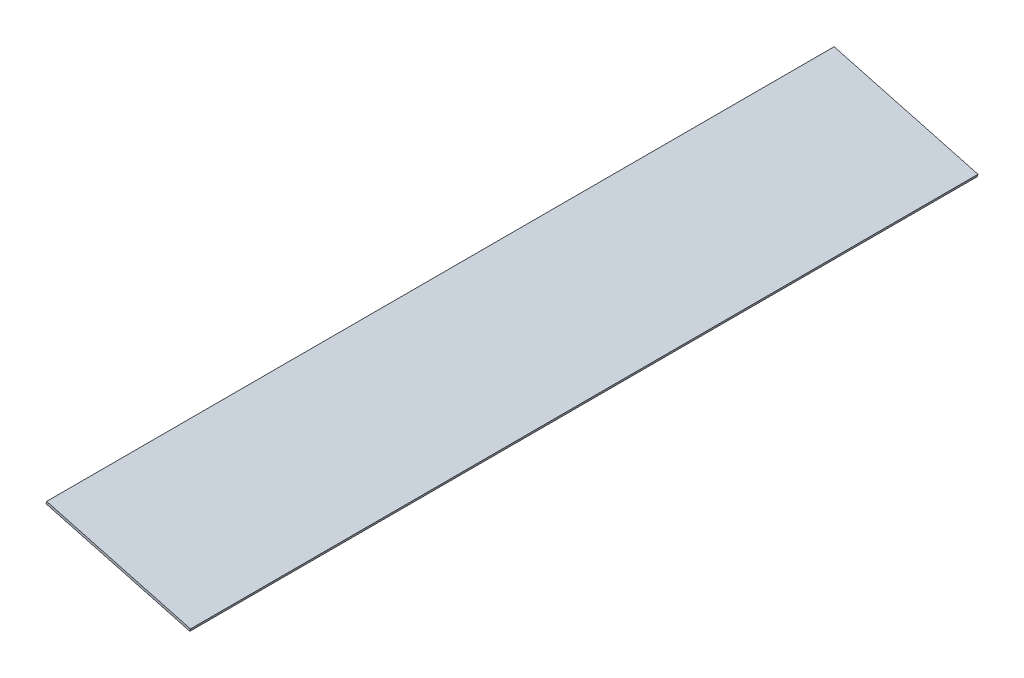
ISO-10303-21;
HEADER;
FILE_DESCRIPTION(('STEP AP214'),'2;1');
FILE_NAME('part.step','',(''),(''),'','','');
FILE_SCHEMA(('AUTOMOTIVE_DESIGN { 1 0 10303 214 1 1 1 1 }'));
ENDSEC;
DATA;
#1=APPLICATION_CONTEXT('core data for automotive mechanical design processes');
#2=APPLICATION_PROTOCOL_DEFINITION('international standard','automotive_design',2000,#1);
#3=PRODUCT_CONTEXT('',#1,'mechanical');
#4=PRODUCT('Part','Part','',(#3));
#5=PRODUCT_RELATED_PRODUCT_CATEGORY('part','',(#4));
#6=PRODUCT_DEFINITION_FORMATION('','',#4);
#7=PRODUCT_DEFINITION_CONTEXT('part definition',#1,'design');
#8=PRODUCT_DEFINITION('design','',#6,#7);
#9=PRODUCT_DEFINITION_SHAPE('','',#8);
#10=(LENGTH_UNIT() NAMED_UNIT(*) SI_UNIT(.MILLI.,.METRE.));
#11=(NAMED_UNIT(*) PLANE_ANGLE_UNIT() SI_UNIT($,.RADIAN.));
#12=(NAMED_UNIT(*) SI_UNIT($,.STERADIAN.) SOLID_ANGLE_UNIT());
#13=UNCERTAINTY_MEASURE_WITH_UNIT(LENGTH_MEASURE(1.E-05),#10,'distance_accuracy_value','');
#14=(GEOMETRIC_REPRESENTATION_CONTEXT(3) GLOBAL_UNCERTAINTY_ASSIGNED_CONTEXT((#13)) GLOBAL_UNIT_ASSIGNED_CONTEXT((#10,
#11,#12)) REPRESENTATION_CONTEXT('',''));
#15=CARTESIAN_POINT('',(0.,0.,0.));
#16=DIRECTION('',(0.,0.,1.));
#17=DIRECTION('',(1.,0.,0.));
#18=AXIS2_PLACEMENT_3D('',#15,#16,#17);
#19=CARTESIAN_POINT('',(0.,0.,511.175));
#20=DIRECTION('',(-0.965925826289068,0.258819045102521,0.));
#21=DIRECTION('',(-0.258819045102521,-0.965925826289068,0.));
#22=AXIS2_PLACEMENT_3D('',#19,#20,#21);
#23=PLANE('',#22);
#24=DIRECTION('',(0.258819045102521,0.965925826289068,0.));
#25=VECTOR('',#24,1.);
#26=CARTESIAN_POINT('',(0.,0.,0.));
#27=LINE('',#26,#25);
#28=CARTESIAN_POINT('',(0.,0.,0.));
#29=VERTEX_POINT('',#28);
#30=CARTESIAN_POINT('',(0.410875234100252,1.53340724923389,0.));
#31=VERTEX_POINT('',#30);
#32=EDGE_CURVE('E95',#29,#31,#27,.T.);
#33=ORIENTED_EDGE('',*,*,#32,.T.);
#34=DIRECTION('',(0.,0.,-1.));
#35=VECTOR('',#34,1.);
#36=CARTESIAN_POINT('',(0.410875234100252,1.53340724923389,511.175));
#37=LINE('',#36,#35);
#38=CARTESIAN_POINT('',(0.410875234100252,1.53340724923389,511.175));
#39=VERTEX_POINT('',#38);
#40=EDGE_CURVE('E11',#39,#31,#37,.T.);
#41=ORIENTED_EDGE('',*,*,#40,.F.);
#42=DIRECTION('',(0.258819045102521,0.965925826289068,0.));
#43=VECTOR('',#42,1.);
#44=CARTESIAN_POINT('',(0.,0.,511.175));
#45=LINE('',#44,#43);
#46=CARTESIAN_POINT('',(0.,0.,511.175));
#47=VERTEX_POINT('',#46);
#48=EDGE_CURVE('E83',#47,#39,#45,.T.);
#49=ORIENTED_EDGE('',*,*,#48,.F.);
#50=DIRECTION('',(0.,0.,-1.));
#51=VECTOR('',#50,1.);
#52=CARTESIAN_POINT('',(0.,0.,511.175));
#53=LINE('',#52,#51);
#54=EDGE_CURVE('E91',#47,#29,#53,.T.);
#55=ORIENTED_EDGE('',*,*,#54,.T.);
#56=EDGE_LOOP('',(#33,#41,#49,#55));
#57=FACE_BOUND('',#56,.T.);
#58=ADVANCED_FACE('F32',(#57),#23,.F.);
#59=CARTESIAN_POINT('',(0.410875234100252,1.53340724923389,511.175));
#60=DIRECTION('',(-0.258819045102521,-0.965925826289068,0.));
#61=DIRECTION('',(0.965925826289068,-0.258819045102521,0.));
#62=AXIS2_PLACEMENT_3D('',#59,#60,#61);
#63=PLANE('',#62);
#64=DIRECTION('',(-0.965925826289068,0.258819045102521,0.));
#65=VECTOR('',#64,1.);
#66=CARTESIAN_POINT('',(0.410875234100252,1.53340724923389,0.));
#67=LINE('',#66,#65);
#68=CARTESIAN_POINT('',(-92.9613039204655,26.5524072492339,0.));
#69=VERTEX_POINT('',#68);
#70=EDGE_CURVE('E87',#31,#69,#67,.T.);
#71=ORIENTED_EDGE('',*,*,#70,.T.);
#72=DIRECTION('',(0.,0.,-1.));
#73=VECTOR('',#72,1.);
#74=CARTESIAN_POINT('',(-92.9613039204655,26.5524072492339,511.175));
#75=LINE('',#74,#73);
#76=CARTESIAN_POINT('',(-92.9613039204655,26.5524072492339,511.175));
#77=VERTEX_POINT('',#76);
#78=EDGE_CURVE('E40',#77,#69,#75,.T.);
#79=ORIENTED_EDGE('',*,*,#78,.F.);
#80=DIRECTION('',(-0.965925826289068,0.258819045102521,0.));
#81=VECTOR('',#80,1.);
#82=CARTESIAN_POINT('',(0.410875234100252,1.53340724923389,511.175));
#83=LINE('',#82,#81);
#84=EDGE_CURVE('E78',#39,#77,#83,.T.);
#85=ORIENTED_EDGE('',*,*,#84,.F.);
#86=ORIENTED_EDGE('',*,*,#40,.T.);
#87=EDGE_LOOP('',(#71,#79,#85,#86));
#88=FACE_BOUND('',#87,.T.);
#89=ADVANCED_FACE('F86',(#88),#63,.F.);
#90=CARTESIAN_POINT('',(-92.9613039204655,26.5524072492339,511.175));
#91=DIRECTION('',(0.965925826289067,-0.258819045102524,0.));
#92=DIRECTION('',(0.258819045102524,0.965925826289068,0.));
#93=AXIS2_PLACEMENT_3D('',#90,#91,#92);
#94=PLANE('',#93);
#95=DIRECTION('',(-0.258819045102524,-0.965925826289067,0.));
#96=VECTOR('',#95,1.);
#97=CARTESIAN_POINT('',(-92.9613039204655,26.5524072492339,0.));
#98=LINE('',#97,#96);
#99=CARTESIAN_POINT('',(-93.3721791545657,25.019,0.));
#100=VERTEX_POINT('',#99);
#101=EDGE_CURVE('E65',#69,#100,#98,.T.);
#102=ORIENTED_EDGE('',*,*,#101,.T.);
#103=DIRECTION('',(0.,0.,-1.));
#104=VECTOR('',#103,1.);
#105=CARTESIAN_POINT('',(-93.3721791545657,25.019,511.175));
#106=LINE('',#105,#104);
#107=CARTESIAN_POINT('',(-93.3721791545657,25.019,511.175));
#108=VERTEX_POINT('',#107);
#109=EDGE_CURVE('E88',#108,#100,#106,.T.);
#110=ORIENTED_EDGE('',*,*,#109,.F.);
#111=DIRECTION('',(-0.258819045102524,-0.965925826289067,0.));
#112=VECTOR('',#111,1.);
#113=CARTESIAN_POINT('',(-92.9613039204655,26.5524072492339,511.175));
#114=LINE('',#113,#112);
#115=EDGE_CURVE('E81',#77,#108,#114,.T.);
#116=ORIENTED_EDGE('',*,*,#115,.F.);
#117=ORIENTED_EDGE('',*,*,#78,.T.);
#118=EDGE_LOOP('',(#102,#110,#116,#117));
#119=FACE_BOUND('',#118,.T.);
#120=ADVANCED_FACE('F89',(#119),#94,.F.);
#121=CARTESIAN_POINT('',(0.,0.,511.175));
#122=DIRECTION('',(0.258819045102521,0.965925826289068,0.));
#123=DIRECTION('',(-0.965925826289068,0.258819045102521,0.));
#124=AXIS2_PLACEMENT_3D('',#121,#122,#123);
#125=PLANE('',#124);
#126=DIRECTION('',(0.965925826289068,-0.258819045102521,0.));
#127=VECTOR('',#126,1.);
#128=CARTESIAN_POINT('',(0.,0.,0.));
#129=LINE('',#128,#127);
#130=EDGE_CURVE('E71',#100,#29,#129,.T.);
#131=ORIENTED_EDGE('',*,*,#130,.T.);
#132=ORIENTED_EDGE('',*,*,#54,.F.);
#133=DIRECTION('',(0.965925826289068,-0.258819045102521,0.));
#134=VECTOR('',#133,1.);
#135=CARTESIAN_POINT('',(0.,0.,511.175));
#136=LINE('',#135,#134);
#137=EDGE_CURVE('E48',#108,#47,#136,.T.);
#138=ORIENTED_EDGE('',*,*,#137,.F.);
#139=ORIENTED_EDGE('',*,*,#109,.T.);
#140=EDGE_LOOP('',(#131,#132,#138,#139));
#141=FACE_BOUND('',#140,.T.);
#142=ADVANCED_FACE('F102',(#141),#125,.F.);
#143=CARTESIAN_POINT('',(0.,0.,511.175));
#144=DIRECTION('',(0.,0.,1.));
#145=DIRECTION('',(1.,0.,0.));
#146=AXIS2_PLACEMENT_3D('',#143,#144,#145);
#147=PLANE('',#146);
#148=ORIENTED_EDGE('',*,*,#48,.T.);
#149=ORIENTED_EDGE('',*,*,#84,.T.);
#150=ORIENTED_EDGE('',*,*,#115,.T.);
#151=ORIENTED_EDGE('',*,*,#137,.T.);
#152=EDGE_LOOP('',(#148,#149,#150,#151));
#153=FACE_BOUND('',#152,.T.);
#154=ADVANCED_FACE('F79',(#153),#147,.T.);
#155=CARTESIAN_POINT('',(0.,0.,0.));
#156=DIRECTION('',(0.,0.,1.));
#157=DIRECTION('',(1.,0.,0.));
#158=AXIS2_PLACEMENT_3D('',#155,#156,#157);
#159=PLANE('',#158);
#160=ORIENTED_EDGE('',*,*,#32,.F.);
#161=ORIENTED_EDGE('',*,*,#130,.F.);
#162=ORIENTED_EDGE('',*,*,#101,.F.);
#163=ORIENTED_EDGE('',*,*,#70,.F.);
#164=EDGE_LOOP('',(#160,#161,#162,#163));
#165=FACE_BOUND('',#164,.T.);
#166=ADVANCED_FACE('F105',(#165),#159,.F.);
#167=CLOSED_SHELL('',(#58,#89,#120,#142,#154,#166));
#168=MANIFOLD_SOLID_BREP('B2',#167);
#169=ADVANCED_BREP_SHAPE_REPRESENTATION('',(#18,#168),#14);
#170=SHAPE_DEFINITION_REPRESENTATION(#9,#169);
ENDSEC;
END-ISO-10303-21;
